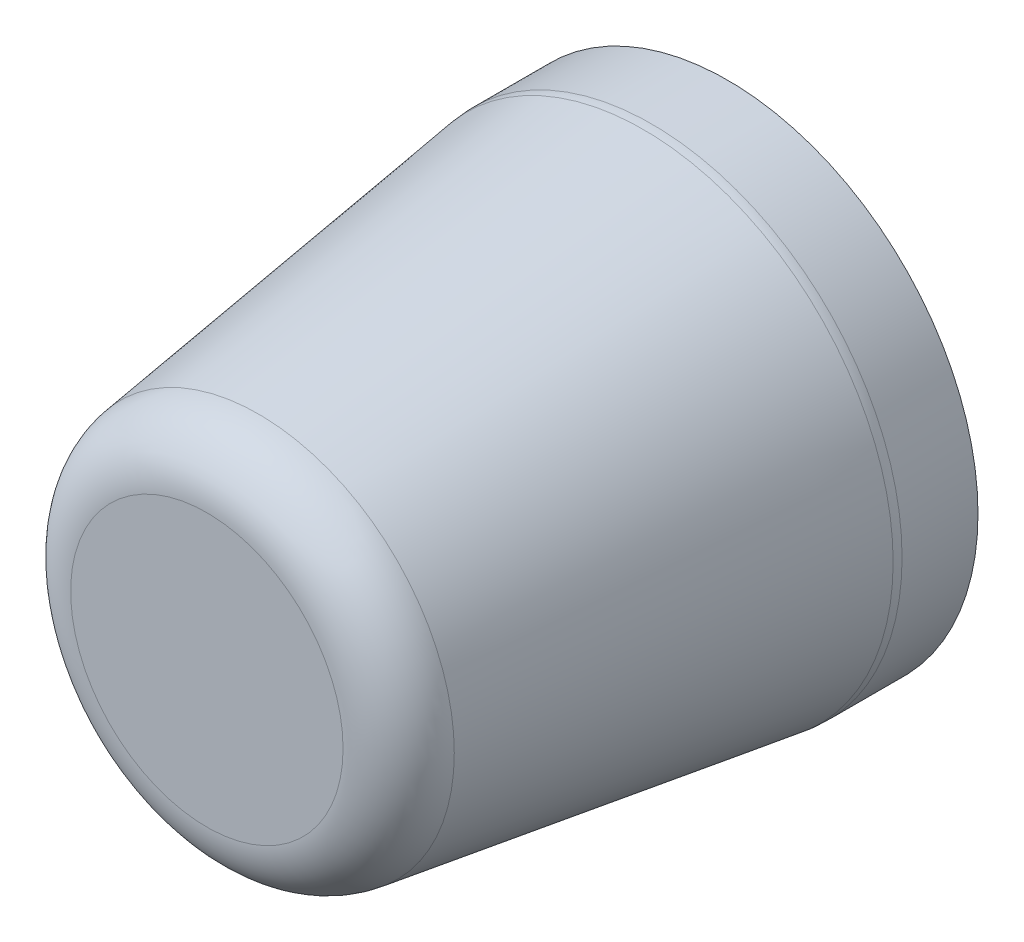
ISO-10303-21;
HEADER;
FILE_DESCRIPTION(('STEP AP214'),'2;1');
FILE_NAME('part.step','',(''),(''),'','','');
FILE_SCHEMA(('AUTOMOTIVE_DESIGN { 1 0 10303 214 1 1 1 1 }'));
ENDSEC;
DATA;
#1=APPLICATION_CONTEXT('core data for automotive mechanical design processes');
#2=APPLICATION_PROTOCOL_DEFINITION('international standard','automotive_design',2000,#1);
#3=PRODUCT_CONTEXT('',#1,'mechanical');
#4=PRODUCT('Part','Part','',(#3));
#5=PRODUCT_RELATED_PRODUCT_CATEGORY('part','',(#4));
#6=PRODUCT_DEFINITION_FORMATION('','',#4);
#7=PRODUCT_DEFINITION_CONTEXT('part definition',#1,'design');
#8=PRODUCT_DEFINITION('design','',#6,#7);
#9=PRODUCT_DEFINITION_SHAPE('','',#8);
#10=(LENGTH_UNIT() NAMED_UNIT(*) SI_UNIT(.MILLI.,.METRE.));
#11=(NAMED_UNIT(*) PLANE_ANGLE_UNIT() SI_UNIT($,.RADIAN.));
#12=(NAMED_UNIT(*) SI_UNIT($,.STERADIAN.) SOLID_ANGLE_UNIT());
#13=UNCERTAINTY_MEASURE_WITH_UNIT(LENGTH_MEASURE(1.E-05),#10,'distance_accuracy_value','');
#14=(GEOMETRIC_REPRESENTATION_CONTEXT(3) GLOBAL_UNCERTAINTY_ASSIGNED_CONTEXT((#13)) GLOBAL_UNIT_ASSIGNED_CONTEXT((#10,
#11,#12)) REPRESENTATION_CONTEXT('',''));
#15=CARTESIAN_POINT('',(0.,0.,0.));
#16=DIRECTION('',(0.,0.,1.));
#17=DIRECTION('',(1.,0.,0.));
#18=AXIS2_PLACEMENT_3D('',#15,#16,#17);
#19=CARTESIAN_POINT('',(0.,9.40810163654738,26.));
#20=DIRECTION('',(0.,0.,1.));
#21=DIRECTION('',(1.,0.,0.));
#22=AXIS2_PLACEMENT_3D('',#19,#20,#21);
#23=PLANE('',#22);
#24=CARTESIAN_POINT('',(0.,0.,26.));
#25=DIRECTION('',(0.,0.,1.));
#26=DIRECTION('',(1.,0.,0.));
#27=AXIS2_PLACEMENT_3D('',#24,#25,#26);
#28=CIRCLE('',#27,6.8002414230987);
#29=CARTESIAN_POINT('',(6.8002414230987,0.,26.));
#30=VERTEX_POINT('',#29);
#31=EDGE_CURVE('E22',#30,#30,#28,.T.);
#32=ORIENTED_EDGE('',*,*,#31,.T.);
#33=EDGE_LOOP('',(#32));
#34=FACE_BOUND('',#33,.T.);
#35=ADVANCED_FACE('F15',(#34),#23,.T.);
#36=CARTESIAN_POINT('',(0.,0.,15.));
#37=DIRECTION('',(0.,0.,-1.));
#38=DIRECTION('',(-1.,0.,0.));
#39=AXIS2_PLACEMENT_3D('',#36,#37,#38);
#40=PLANE('',#39);
#41=CARTESIAN_POINT('',(0.,0.,15.));
#42=DIRECTION('',(0.,0.,-1.));
#43=DIRECTION('',(-1.,0.,0.));
#44=AXIS2_PLACEMENT_3D('',#41,#42,#43);
#45=CIRCLE('',#44,2.);
#46=CARTESIAN_POINT('',(-2.,0.,15.));
#47=VERTEX_POINT('',#46);
#48=EDGE_CURVE('E35',#47,#47,#45,.T.);
#49=ORIENTED_EDGE('',*,*,#48,.T.);
#50=EDGE_LOOP('',(#49));
#51=FACE_BOUND('',#50,.T.);
#52=ADVANCED_FACE('F64',(#51),#40,.T.);
#53=CARTESIAN_POINT('',(0.,0.,0.));
#54=DIRECTION('',(0.,0.,-1.));
#55=DIRECTION('',(-1.,0.,0.));
#56=AXIS2_PLACEMENT_3D('',#53,#54,#55);
#57=CYLINDRICAL_SURFACE('',#56,2.);
#58=CARTESIAN_POINT('',(0.,0.,0.));
#59=DIRECTION('',(0.,0.,-1.));
#60=DIRECTION('',(-1.,0.,0.));
#61=AXIS2_PLACEMENT_3D('',#58,#59,#60);
#62=CIRCLE('',#61,2.);
#63=CARTESIAN_POINT('',(-2.,0.,0.));
#64=VERTEX_POINT('',#63);
#65=EDGE_CURVE('E38',#64,#64,#62,.T.);
#66=ORIENTED_EDGE('',*,*,#65,.T.);
#67=EDGE_LOOP('',(#66));
#68=FACE_BOUND('',#67,.T.);
#69=ORIENTED_EDGE('',*,*,#48,.F.);
#70=EDGE_LOOP('',(#69));
#71=FACE_BOUND('',#70,.T.);
#72=ADVANCED_FACE('F61',(#68,#71),#57,.F.);
#73=CARTESIAN_POINT('',(0.,2.,0.));
#74=DIRECTION('',(0.,0.,-1.));
#75=DIRECTION('',(-1.,0.,0.));
#76=AXIS2_PLACEMENT_3D('',#73,#74,#75);
#77=PLANE('',#76);
#78=CARTESIAN_POINT('',(0.,0.,0.));
#79=DIRECTION('',(0.,0.,-1.));
#80=DIRECTION('',(-1.,0.,0.));
#81=AXIS2_PLACEMENT_3D('',#78,#79,#80);
#82=CIRCLE('',#81,12.5);
#83=CARTESIAN_POINT('',(-12.5,0.,0.));
#84=VERTEX_POINT('',#83);
#85=EDGE_CURVE('E41',#84,#84,#82,.T.);
#86=ORIENTED_EDGE('',*,*,#85,.T.);
#87=EDGE_LOOP('',(#86));
#88=FACE_BOUND('',#87,.T.);
#89=ORIENTED_EDGE('',*,*,#65,.F.);
#90=EDGE_LOOP('',(#89));
#91=FACE_BOUND('',#90,.T.);
#92=ADVANCED_FACE('F45',(#88,#91),#77,.T.);
#93=CARTESIAN_POINT('',(0.,0.,0.));
#94=DIRECTION('',(0.,0.,-1.));
#95=DIRECTION('',(-1.,0.,0.));
#96=AXIS2_PLACEMENT_3D('',#93,#94,#95);
#97=CYLINDRICAL_SURFACE('',#96,12.5);
#98=CARTESIAN_POINT('',(0.,0.,3.79021956416948));
#99=DIRECTION('',(0.,0.,1.));
#100=DIRECTION('',(1.,0.,0.));
#101=AXIS2_PLACEMENT_3D('',#98,#99,#100);
#102=CIRCLE('',#101,12.5);
#103=CARTESIAN_POINT('',(12.5,0.,3.79021956416948));
#104=VERTEX_POINT('',#103);
#105=EDGE_CURVE('E10',#104,#104,#102,.F.);
#106=ORIENTED_EDGE('',*,*,#105,.T.);
#107=EDGE_LOOP('',(#106));
#108=FACE_BOUND('',#107,.T.);
#109=ORIENTED_EDGE('',*,*,#85,.F.);
#110=EDGE_LOOP('',(#109));
#111=FACE_BOUND('',#110,.T.);
#112=ADVANCED_FACE('F48',(#108,#111),#97,.T.);
#113=CARTESIAN_POINT('',(0.,0.,4.));
#114=DIRECTION('',(0.,0.,-1.));
#115=DIRECTION('',(-1.,0.,0.));
#116=AXIS2_PLACEMENT_3D('',#113,#114,#115);
#117=CONICAL_SURFACE('',#116,12.5,0.139626340159547);
#118=CARTESIAN_POINT('',(0.,0.,23.4175193028802));
#119=DIRECTION('',(0.,0.,1.));
#120=DIRECTION('',(1.,0.,0.));
#121=AXIS2_PLACEMENT_3D('',#118,#119,#120);
#122=CIRCLE('',#121,9.77104562932341);
#123=CARTESIAN_POINT('',(9.77104562932341,0.,23.4175193028802));
#124=VERTEX_POINT('',#123);
#125=EDGE_CURVE('E26',#124,#124,#122,.F.);
#126=ORIENTED_EDGE('',*,*,#125,.T.);
#127=EDGE_LOOP('',(#126));
#128=FACE_BOUND('',#127,.T.);
#129=CARTESIAN_POINT('',(0.,0.,4.20773886704966));
#130=DIRECTION('',(0.,0.,1.));
#131=DIRECTION('',(1.,0.,0.));
#132=AXIS2_PLACEMENT_3D('',#129,#130,#131);
#133=CIRCLE('',#132,12.4708042062247);
#134=CARTESIAN_POINT('',(12.4708042062247,0.,4.20773886704966));
#135=VERTEX_POINT('',#134);
#136=EDGE_CURVE('E30',#135,#135,#133,.T.);
#137=ORIENTED_EDGE('',*,*,#136,.T.);
#138=EDGE_LOOP('',(#137));
#139=FACE_BOUND('',#138,.T.);
#140=ADVANCED_FACE('F50',(#128,#139),#117,.T.);
#141=CARTESIAN_POINT('',(0.,0.,23.));
#142=DIRECTION('',(0.,0.,1.));
#143=DIRECTION('',(1.,0.,0.));
#144=AXIS2_PLACEMENT_3D('',#141,#142,#143);
#145=TOROIDAL_SURFACE('',#144,6.8002414230987,3.);
#146=ORIENTED_EDGE('',*,*,#31,.F.);
#147=EDGE_LOOP('',(#146));
#148=FACE_BOUND('',#147,.T.);
#149=ORIENTED_EDGE('',*,*,#125,.F.);
#150=EDGE_LOOP('',(#149));
#151=FACE_BOUND('',#150,.T.);
#152=ADVANCED_FACE('F58',(#148,#151),#145,.T.);
#153=CARTESIAN_POINT('',(0.,0.,3.79021956416948));
#154=DIRECTION('',(0.,0.,1.));
#155=DIRECTION('',(1.,0.,0.));
#156=AXIS2_PLACEMENT_3D('',#153,#154,#155);
#157=TOROIDAL_SURFACE('',#156,9.5,3.);
#158=ORIENTED_EDGE('',*,*,#136,.F.);
#159=EDGE_LOOP('',(#158));
#160=FACE_BOUND('',#159,.T.);
#161=ORIENTED_EDGE('',*,*,#105,.F.);
#162=EDGE_LOOP('',(#161));
#163=FACE_BOUND('',#162,.T.);
#164=ADVANCED_FACE('F17',(#160,#163),#157,.T.);
#165=CLOSED_SHELL('',(#35,#52,#72,#92,#112,#140,#152,#164));
#166=MANIFOLD_SOLID_BREP('B1',#165);
#167=ADVANCED_BREP_SHAPE_REPRESENTATION('',(#18,#166),#14);
#168=SHAPE_DEFINITION_REPRESENTATION(#9,#167);
ENDSEC;
END-ISO-10303-21;
